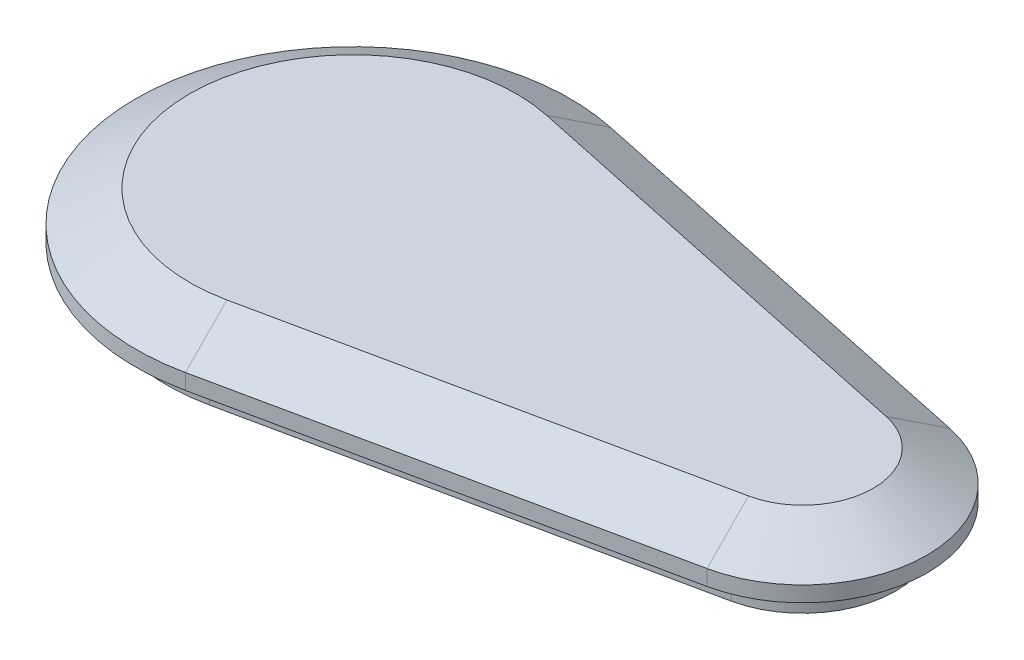
ISO-10303-21;
HEADER;
FILE_DESCRIPTION(('STEP AP214'),'2;1');
FILE_NAME('part.step','',(''),(''),'','','');
FILE_SCHEMA(('AUTOMOTIVE_DESIGN { 1 0 10303 214 1 1 1 1 }'));
ENDSEC;
DATA;
#1=APPLICATION_CONTEXT('core data for automotive mechanical design processes');
#2=APPLICATION_PROTOCOL_DEFINITION('international standard','automotive_design',2000,#1);
#3=PRODUCT_CONTEXT('',#1,'mechanical');
#4=PRODUCT('Part','Part','',(#3));
#5=PRODUCT_RELATED_PRODUCT_CATEGORY('part','',(#4));
#6=PRODUCT_DEFINITION_FORMATION('','',#4);
#7=PRODUCT_DEFINITION_CONTEXT('part definition',#1,'design');
#8=PRODUCT_DEFINITION('design','',#6,#7);
#9=PRODUCT_DEFINITION_SHAPE('','',#8);
#10=(LENGTH_UNIT() NAMED_UNIT(*) SI_UNIT(.MILLI.,.METRE.));
#11=(NAMED_UNIT(*) PLANE_ANGLE_UNIT() SI_UNIT($,.RADIAN.));
#12=(NAMED_UNIT(*) SI_UNIT($,.STERADIAN.) SOLID_ANGLE_UNIT());
#13=UNCERTAINTY_MEASURE_WITH_UNIT(LENGTH_MEASURE(1.E-05),#10,'distance_accuracy_value','');
#14=(GEOMETRIC_REPRESENTATION_CONTEXT(3) GLOBAL_UNCERTAINTY_ASSIGNED_CONTEXT((#13)) GLOBAL_UNIT_ASSIGNED_CONTEXT((#10,
#11,#12)) REPRESENTATION_CONTEXT('',''));
#15=CARTESIAN_POINT('',(0.,0.,0.));
#16=DIRECTION('',(0.,0.,1.));
#17=DIRECTION('',(1.,0.,0.));
#18=AXIS2_PLACEMENT_3D('',#15,#16,#17);
#19=CARTESIAN_POINT('',(0.,2.,0.));
#20=DIRECTION('',(0.,-1.,0.));
#21=DIRECTION('',(0.,0.,-1.));
#22=AXIS2_PLACEMENT_3D('',#19,#20,#21);
#23=CYLINDRICAL_SURFACE('',#22,12.);
#24=CARTESIAN_POINT('',(0.,0.,0.));
#25=DIRECTION('',(0.,1.,0.));
#26=DIRECTION('',(0.,0.,1.));
#27=AXIS2_PLACEMENT_3D('',#24,#25,#26);
#28=CIRCLE('',#27,12.);
#29=CARTESIAN_POINT('',(2.48275862068966,0.,-11.7403538971954));
#30=VERTEX_POINT('',#29);
#31=CARTESIAN_POINT('',(2.48275862068965,0.,11.7403538971954));
#32=VERTEX_POINT('',#31);
#33=EDGE_CURVE('E214',#30,#32,#28,.T.);
#34=ORIENTED_EDGE('',*,*,#33,.T.);
#35=DIRECTION('',(0.,-1.,0.));
#36=VECTOR('',#35,1.);
#37=CARTESIAN_POINT('',(2.48275862068965,2.,11.7403538971954));
#38=LINE('',#37,#36);
#39=CARTESIAN_POINT('',(2.48275862068965,2.,11.7403538971954));
#40=VERTEX_POINT('',#39);
#41=EDGE_CURVE('E11',#40,#32,#38,.T.);
#42=ORIENTED_EDGE('',*,*,#41,.F.);
#43=CARTESIAN_POINT('',(0.,2.,0.));
#44=DIRECTION('',(0.,1.,0.));
#45=DIRECTION('',(0.,0.,1.));
#46=AXIS2_PLACEMENT_3D('',#43,#44,#45);
#47=CIRCLE('',#46,12.);
#48=CARTESIAN_POINT('',(2.48275862068966,2.,-11.7403538971954));
#49=VERTEX_POINT('',#48);
#50=EDGE_CURVE('E215',#49,#40,#47,.T.);
#51=ORIENTED_EDGE('',*,*,#50,.F.);
#52=DIRECTION('',(0.,-1.,0.));
#53=VECTOR('',#52,1.);
#54=CARTESIAN_POINT('',(2.48275862068966,2.,-11.7403538971954));
#55=LINE('',#54,#53);
#56=EDGE_CURVE('E229',#49,#30,#55,.T.);
#57=ORIENTED_EDGE('',*,*,#56,.T.);
#58=EDGE_LOOP('',(#34,#42,#51,#57));
#59=FACE_BOUND('',#58,.T.);
#60=ADVANCED_FACE('F39',(#59),#23,.T.);
#61=CARTESIAN_POINT('',(2.48275862068965,2.,11.7403538971954));
#62=DIRECTION('',(-0.206896551724138,0.,-0.978362824766283));
#63=DIRECTION('',(-0.978362824766283,0.,0.206896551724138));
#64=AXIS2_PLACEMENT_3D('',#61,#62,#63);
#65=PLANE('',#64);
#66=DIRECTION('',(0.978362824766283,0.,-0.206896551724138));
#67=VECTOR('',#66,1.);
#68=CARTESIAN_POINT('',(2.48275862068965,0.,11.7403538971954));
#69=LINE('',#68,#67);
#70=CARTESIAN_POINT('',(30.2413793103448,0.,5.8701769485977));
#71=VERTEX_POINT('',#70);
#72=EDGE_CURVE('E233',#32,#71,#69,.T.);
#73=ORIENTED_EDGE('',*,*,#72,.T.);
#74=DIRECTION('',(0.,-1.,0.));
#75=VECTOR('',#74,1.);
#76=CARTESIAN_POINT('',(30.2413793103448,2.,5.8701769485977));
#77=LINE('',#76,#75);
#78=CARTESIAN_POINT('',(30.2413793103448,2.,5.8701769485977));
#79=VERTEX_POINT('',#78);
#80=EDGE_CURVE('E48',#79,#71,#77,.T.);
#81=ORIENTED_EDGE('',*,*,#80,.F.);
#82=DIRECTION('',(0.978362824766283,0.,-0.206896551724138));
#83=VECTOR('',#82,1.);
#84=CARTESIAN_POINT('',(2.48275862068965,2.,11.7403538971954));
#85=LINE('',#84,#83);
#86=EDGE_CURVE('E82',#40,#79,#85,.T.);
#87=ORIENTED_EDGE('',*,*,#86,.F.);
#88=ORIENTED_EDGE('',*,*,#41,.T.);
#89=EDGE_LOOP('',(#73,#81,#87,#88));
#90=FACE_BOUND('',#89,.T.);
#91=ADVANCED_FACE('F265',(#90),#65,.F.);
#92=CARTESIAN_POINT('',(29.,2.,0.));
#93=DIRECTION('',(0.,-1.,0.));
#94=DIRECTION('',(0.,0.,-1.));
#95=AXIS2_PLACEMENT_3D('',#92,#93,#94);
#96=CYLINDRICAL_SURFACE('',#95,6.);
#97=CARTESIAN_POINT('',(29.,0.,0.));
#98=DIRECTION('',(0.,1.,0.));
#99=DIRECTION('',(0.,0.,1.));
#100=AXIS2_PLACEMENT_3D('',#97,#98,#99);
#101=CIRCLE('',#100,6.);
#102=CARTESIAN_POINT('',(30.2413793103448,0.,-5.8701769485977));
#103=VERTEX_POINT('',#102);
#104=EDGE_CURVE('E72',#71,#103,#101,.T.);
#105=ORIENTED_EDGE('',*,*,#104,.T.);
#106=DIRECTION('',(0.,-1.,0.));
#107=VECTOR('',#106,1.);
#108=CARTESIAN_POINT('',(30.2413793103448,2.,-5.8701769485977));
#109=LINE('',#108,#107);
#110=CARTESIAN_POINT('',(30.2413793103448,2.,-5.8701769485977));
#111=VERTEX_POINT('',#110);
#112=EDGE_CURVE('E56',#111,#103,#109,.T.);
#113=ORIENTED_EDGE('',*,*,#112,.F.);
#114=CARTESIAN_POINT('',(29.,2.,0.));
#115=DIRECTION('',(0.,1.,0.));
#116=DIRECTION('',(0.,0.,1.));
#117=AXIS2_PLACEMENT_3D('',#114,#115,#116);
#118=CIRCLE('',#117,6.);
#119=EDGE_CURVE('E221',#79,#111,#118,.T.);
#120=ORIENTED_EDGE('',*,*,#119,.F.);
#121=ORIENTED_EDGE('',*,*,#80,.T.);
#122=EDGE_LOOP('',(#105,#113,#120,#121));
#123=FACE_BOUND('',#122,.T.);
#124=ADVANCED_FACE('F244',(#123),#96,.T.);
#125=CARTESIAN_POINT('',(2.48275862068966,2.,-11.7403538971954));
#126=DIRECTION('',(-0.206896551724138,0.,0.978362824766283));
#127=DIRECTION('',(0.978362824766283,0.,0.206896551724138));
#128=AXIS2_PLACEMENT_3D('',#125,#126,#127);
#129=PLANE('',#128);
#130=DIRECTION('',(-0.978362824766283,0.,-0.206896551724138));
#131=VECTOR('',#130,1.);
#132=CARTESIAN_POINT('',(2.48275862068966,0.,-11.7403538971954));
#133=LINE('',#132,#131);
#134=EDGE_CURVE('E77',#103,#30,#133,.T.);
#135=ORIENTED_EDGE('',*,*,#134,.T.);
#136=ORIENTED_EDGE('',*,*,#56,.F.);
#137=DIRECTION('',(-0.978362824766283,0.,-0.206896551724138));
#138=VECTOR('',#137,1.);
#139=CARTESIAN_POINT('',(2.48275862068966,2.,-11.7403538971954));
#140=LINE('',#139,#138);
#141=EDGE_CURVE('E225',#111,#49,#140,.T.);
#142=ORIENTED_EDGE('',*,*,#141,.F.);
#143=ORIENTED_EDGE('',*,*,#112,.T.);
#144=EDGE_LOOP('',(#135,#136,#142,#143));
#145=FACE_BOUND('',#144,.T.);
#146=ADVANCED_FACE('F249',(#145),#129,.F.);
#147=CARTESIAN_POINT('',(0.,0.,0.));
#148=DIRECTION('',(0.,1.,0.));
#149=DIRECTION('',(0.,0.,1.));
#150=AXIS2_PLACEMENT_3D('',#147,#148,#149);
#151=PLANE('',#150);
#152=ORIENTED_EDGE('',*,*,#33,.F.);
#153=ORIENTED_EDGE('',*,*,#134,.F.);
#154=ORIENTED_EDGE('',*,*,#104,.F.);
#155=ORIENTED_EDGE('',*,*,#72,.F.);
#156=EDGE_LOOP('',(#152,#153,#154,#155));
#157=FACE_BOUND('',#156,.T.);
#158=ADVANCED_FACE('F247',(#157),#151,.F.);
#159=CARTESIAN_POINT('',(29.,2.,0.));
#160=DIRECTION('',(0.,1.,0.));
#161=DIRECTION('',(0.,0.,1.));
#162=AXIS2_PLACEMENT_3D('',#159,#160,#161);
#163=PLANE('',#162);
#164=CARTESIAN_POINT('',(29.,2.,0.));
#165=DIRECTION('',(0.,1.,0.));
#166=DIRECTION('',(0.,0.,1.));
#167=AXIS2_PLACEMENT_3D('',#164,#165,#166);
#168=CIRCLE('',#167,8.);
#169=CARTESIAN_POINT('',(30.6551724137931,2.,7.82690259813027));
#170=VERTEX_POINT('',#169);
#171=CARTESIAN_POINT('',(30.6551724137931,2.,-7.82690259813027));
#172=VERTEX_POINT('',#171);
#173=EDGE_CURVE('E195',#170,#172,#168,.T.);
#174=ORIENTED_EDGE('',*,*,#173,.F.);
#175=DIRECTION('',(0.978362824766283,0.,-0.206896551724138));
#176=VECTOR('',#175,1.);
#177=CARTESIAN_POINT('',(2.89655172413793,2.,13.697079546728));
#178=LINE('',#177,#176);
#179=CARTESIAN_POINT('',(2.89655172413793,2.,13.697079546728));
#180=VERTEX_POINT('',#179);
#181=EDGE_CURVE('E140',#180,#170,#178,.T.);
#182=ORIENTED_EDGE('',*,*,#181,.F.);
#183=CARTESIAN_POINT('',(0.,2.,0.));
#184=DIRECTION('',(0.,1.,0.));
#185=DIRECTION('',(0.,0.,1.));
#186=AXIS2_PLACEMENT_3D('',#183,#184,#185);
#187=CIRCLE('',#186,14.);
#188=CARTESIAN_POINT('',(2.89655172413793,2.,-13.697079546728));
#189=VERTEX_POINT('',#188);
#190=EDGE_CURVE('E201',#189,#180,#187,.T.);
#191=ORIENTED_EDGE('',*,*,#190,.F.);
#192=DIRECTION('',(-0.978362824766283,0.,-0.206896551724138));
#193=VECTOR('',#192,1.);
#194=CARTESIAN_POINT('',(30.6551724137931,2.,-7.82690259813027));
#195=LINE('',#194,#193);
#196=EDGE_CURVE('E198',#172,#189,#195,.T.);
#197=ORIENTED_EDGE('',*,*,#196,.F.);
#198=EDGE_LOOP('',(#174,#182,#191,#197));
#199=FACE_BOUND('',#198,.T.);
#200=ORIENTED_EDGE('',*,*,#141,.T.);
#201=ORIENTED_EDGE('',*,*,#50,.T.);
#202=ORIENTED_EDGE('',*,*,#86,.T.);
#203=ORIENTED_EDGE('',*,*,#119,.T.);
#204=EDGE_LOOP('',(#200,#201,#202,#203));
#205=FACE_BOUND('',#204,.T.);
#206=ADVANCED_FACE('F251',(#199,#205),#163,.F.);
#207=CARTESIAN_POINT('',(29.,3.,0.));
#208=DIRECTION('',(0.,-1.,0.));
#209=DIRECTION('',(0.,0.,-1.));
#210=AXIS2_PLACEMENT_3D('',#207,#208,#209);
#211=CYLINDRICAL_SURFACE('',#210,8.);
#212=ORIENTED_EDGE('',*,*,#173,.T.);
#213=DIRECTION('',(0.,-1.,0.));
#214=VECTOR('',#213,1.);
#215=CARTESIAN_POINT('',(30.6551724137931,3.,-7.82690259813027));
#216=LINE('',#215,#214);
#217=CARTESIAN_POINT('',(30.6551724137931,3.,-7.82690259813027));
#218=VERTEX_POINT('',#217);
#219=EDGE_CURVE('E133',#218,#172,#216,.T.);
#220=ORIENTED_EDGE('',*,*,#219,.F.);
#221=CARTESIAN_POINT('',(29.,3.,0.));
#222=DIRECTION('',(0.,1.,0.));
#223=DIRECTION('',(0.,0.,1.));
#224=AXIS2_PLACEMENT_3D('',#221,#222,#223);
#225=CIRCLE('',#224,8.);
#226=CARTESIAN_POINT('',(30.6551724137931,3.,7.82690259813027));
#227=VERTEX_POINT('',#226);
#228=EDGE_CURVE('E126',#227,#218,#225,.T.);
#229=ORIENTED_EDGE('',*,*,#228,.F.);
#230=DIRECTION('',(0.,-1.,0.));
#231=VECTOR('',#230,1.);
#232=CARTESIAN_POINT('',(30.6551724137931,3.,7.82690259813027));
#233=LINE('',#232,#231);
#234=EDGE_CURVE('E130',#227,#170,#233,.T.);
#235=ORIENTED_EDGE('',*,*,#234,.T.);
#236=EDGE_LOOP('',(#212,#220,#229,#235));
#237=FACE_BOUND('',#236,.T.);
#238=ADVANCED_FACE('F129',(#237),#211,.T.);
#239=CARTESIAN_POINT('',(30.6551724137931,3.,-7.82690259813027));
#240=DIRECTION('',(-0.206896551724138,0.,0.978362824766283));
#241=DIRECTION('',(0.978362824766283,0.,0.206896551724138));
#242=AXIS2_PLACEMENT_3D('',#239,#240,#241);
#243=PLANE('',#242);
#244=ORIENTED_EDGE('',*,*,#196,.T.);
#245=DIRECTION('',(0.,-1.,0.));
#246=VECTOR('',#245,1.);
#247=CARTESIAN_POINT('',(2.89655172413793,3.,-13.697079546728));
#248=LINE('',#247,#246);
#249=CARTESIAN_POINT('',(2.89655172413793,3.,-13.697079546728));
#250=VERTEX_POINT('',#249);
#251=EDGE_CURVE('E208',#250,#189,#248,.T.);
#252=ORIENTED_EDGE('',*,*,#251,.F.);
#253=DIRECTION('',(-0.978362824766283,0.,-0.206896551724138));
#254=VECTOR('',#253,1.);
#255=CARTESIAN_POINT('',(30.6551724137931,3.,-7.82690259813027));
#256=LINE('',#255,#254);
#257=EDGE_CURVE('E139',#218,#250,#256,.T.);
#258=ORIENTED_EDGE('',*,*,#257,.F.);
#259=ORIENTED_EDGE('',*,*,#219,.T.);
#260=EDGE_LOOP('',(#244,#252,#258,#259));
#261=FACE_BOUND('',#260,.T.);
#262=ADVANCED_FACE('F259',(#261),#243,.F.);
#263=CARTESIAN_POINT('',(0.,3.,0.));
#264=DIRECTION('',(0.,-1.,0.));
#265=DIRECTION('',(0.,0.,-1.));
#266=AXIS2_PLACEMENT_3D('',#263,#264,#265);
#267=CYLINDRICAL_SURFACE('',#266,14.);
#268=ORIENTED_EDGE('',*,*,#190,.T.);
#269=DIRECTION('',(0.,-1.,0.));
#270=VECTOR('',#269,1.);
#271=CARTESIAN_POINT('',(2.89655172413793,3.,13.697079546728));
#272=LINE('',#271,#270);
#273=CARTESIAN_POINT('',(2.89655172413793,3.,13.697079546728));
#274=VERTEX_POINT('',#273);
#275=EDGE_CURVE('E151',#274,#180,#272,.T.);
#276=ORIENTED_EDGE('',*,*,#275,.F.);
#277=CARTESIAN_POINT('',(0.,3.,0.));
#278=DIRECTION('',(0.,1.,0.));
#279=DIRECTION('',(0.,0.,1.));
#280=AXIS2_PLACEMENT_3D('',#277,#278,#279);
#281=CIRCLE('',#280,14.);
#282=EDGE_CURVE('E163',#250,#274,#281,.T.);
#283=ORIENTED_EDGE('',*,*,#282,.F.);
#284=ORIENTED_EDGE('',*,*,#251,.T.);
#285=EDGE_LOOP('',(#268,#276,#283,#284));
#286=FACE_BOUND('',#285,.T.);
#287=ADVANCED_FACE('F278',(#286),#267,.T.);
#288=CARTESIAN_POINT('',(2.89655172413793,3.,13.697079546728));
#289=DIRECTION('',(-0.206896551724138,0.,-0.978362824766283));
#290=DIRECTION('',(-0.978362824766283,0.,0.206896551724138));
#291=AXIS2_PLACEMENT_3D('',#288,#289,#290);
#292=PLANE('',#291);
#293=ORIENTED_EDGE('',*,*,#181,.T.);
#294=ORIENTED_EDGE('',*,*,#234,.F.);
#295=DIRECTION('',(0.978362824766283,0.,-0.206896551724138));
#296=VECTOR('',#295,1.);
#297=CARTESIAN_POINT('',(2.89655172413793,3.,13.697079546728));
#298=LINE('',#297,#296);
#299=EDGE_CURVE('E147',#274,#227,#298,.T.);
#300=ORIENTED_EDGE('',*,*,#299,.F.);
#301=ORIENTED_EDGE('',*,*,#275,.T.);
#302=EDGE_LOOP('',(#293,#294,#300,#301));
#303=FACE_BOUND('',#302,.T.);
#304=ADVANCED_FACE('F145',(#303),#292,.F.);
#305=CARTESIAN_POINT('',(29.,3.,0.));
#306=DIRECTION('',(0.,-1.,0.));
#307=DIRECTION('',(0.,0.,1.));
#308=AXIS2_PLACEMENT_3D('',#305,#306,#307);
#309=CONICAL_SURFACE('',#308,8.,1.0471975511966);
#310=ORIENTED_EDGE('',*,*,#228,.T.);
#311=DIRECTION('',(0.179177669748505,-0.499999999999998,-0.847287060365906));
#312=VECTOR('',#311,1.);
#313=CARTESIAN_POINT('',(30.6551724137931,3.,-7.82690259813027));
#314=LINE('',#313,#312);
#315=CARTESIAN_POINT('',(29.9384617347991,5.,-4.43775435666663));
#316=VERTEX_POINT('',#315);
#317=EDGE_CURVE('E178',#316,#218,#314,.T.);
#318=ORIENTED_EDGE('',*,*,#317,.F.);
#319=CARTESIAN_POINT('',(29.,5.,0.));
#320=DIRECTION('',(0.,1.,0.));
#321=DIRECTION('',(0.,0.,1.));
#322=AXIS2_PLACEMENT_3D('',#319,#320,#321);
#323=CIRCLE('',#322,4.53589838486223);
#324=CARTESIAN_POINT('',(29.9384617347991,5.,4.43775435666663));
#325=VERTEX_POINT('',#324);
#326=EDGE_CURVE('E167',#325,#316,#323,.T.);
#327=ORIENTED_EDGE('',*,*,#326,.F.);
#328=DIRECTION('',(0.179177669748505,-0.499999999999998,0.847287060365906));
#329=VECTOR('',#328,1.);
#330=CARTESIAN_POINT('',(30.6551724137931,3.,7.82690259813027));
#331=LINE('',#330,#329);
#332=EDGE_CURVE('E158',#325,#227,#331,.T.);
#333=ORIENTED_EDGE('',*,*,#332,.T.);
#334=EDGE_LOOP('',(#310,#318,#327,#333));
#335=FACE_BOUND('',#334,.T.);
#336=ADVANCED_FACE('F165',(#335),#309,.T.);
#337=CARTESIAN_POINT('',(30.6551724137931,3.,-7.82690259813027));
#338=DIRECTION('',(0.103448275862069,0.86602540378444,-0.48918141238314));
#339=DIRECTION('',(0.,0.491820108607575,0.870696836315162));
#340=AXIS2_PLACEMENT_3D('',#337,#338,#339);
#341=PLANE('',#340);
#342=ORIENTED_EDGE('',*,*,#257,.T.);
#343=DIRECTION('',(0.179177669748504,-0.499999999999998,-0.847287060365906));
#344=VECTOR('',#343,1.);
#345=CARTESIAN_POINT('',(2.89655172413792,3.,-13.697079546728));
#346=LINE('',#345,#344);
#347=CARTESIAN_POINT('',(2.1798410451439,5.,-10.3079313052643));
#348=VERTEX_POINT('',#347);
#349=EDGE_CURVE('E173',#348,#250,#346,.T.);
#350=ORIENTED_EDGE('',*,*,#349,.F.);
#351=DIRECTION('',(0.978362824766283,0.,0.206896551724138));
#352=VECTOR('',#351,1.);
#353=CARTESIAN_POINT('',(29.9384617347991,5.,-4.43775435666663));
#354=LINE('',#353,#352);
#355=EDGE_CURVE('E185',#316,#348,#354,.F.);
#356=ORIENTED_EDGE('',*,*,#355,.F.);
#357=ORIENTED_EDGE('',*,*,#317,.T.);
#358=EDGE_LOOP('',(#342,#350,#356,#357));
#359=FACE_BOUND('',#358,.T.);
#360=ADVANCED_FACE('F286',(#359),#341,.T.);
#361=CARTESIAN_POINT('',(0.,3.,0.));
#362=DIRECTION('',(0.,-1.,0.));
#363=DIRECTION('',(0.,0.,1.));
#364=AXIS2_PLACEMENT_3D('',#361,#362,#363);
#365=CONICAL_SURFACE('',#364,14.,1.0471975511966);
#366=ORIENTED_EDGE('',*,*,#282,.T.);
#367=DIRECTION('',(0.179177669748505,-0.499999999999998,0.847287060365906));
#368=VECTOR('',#367,1.);
#369=CARTESIAN_POINT('',(2.89655172413793,3.,13.697079546728));
#370=LINE('',#369,#368);
#371=CARTESIAN_POINT('',(2.17984104514391,5.,10.3079313052643));
#372=VERTEX_POINT('',#371);
#373=EDGE_CURVE('E161',#372,#274,#370,.T.);
#374=ORIENTED_EDGE('',*,*,#373,.F.);
#375=CARTESIAN_POINT('',(0.,5.,0.));
#376=DIRECTION('',(0.,1.,0.));
#377=DIRECTION('',(0.,0.,1.));
#378=AXIS2_PLACEMENT_3D('',#375,#376,#377);
#379=CIRCLE('',#378,10.5358983848622);
#380=EDGE_CURVE('E175',#348,#372,#379,.T.);
#381=ORIENTED_EDGE('',*,*,#380,.F.);
#382=ORIENTED_EDGE('',*,*,#349,.T.);
#383=EDGE_LOOP('',(#366,#374,#381,#382));
#384=FACE_BOUND('',#383,.T.);
#385=ADVANCED_FACE('F291',(#384),#365,.T.);
#386=CARTESIAN_POINT('',(2.89655172413793,3.,13.697079546728));
#387=DIRECTION('',(0.103448275862069,0.86602540378444,0.48918141238314));
#388=DIRECTION('',(0.,-0.491820108607575,0.870696836315162));
#389=AXIS2_PLACEMENT_3D('',#386,#387,#388);
#390=PLANE('',#389);
#391=ORIENTED_EDGE('',*,*,#299,.T.);
#392=ORIENTED_EDGE('',*,*,#332,.F.);
#393=DIRECTION('',(-0.978362824766283,0.,0.206896551724138));
#394=VECTOR('',#393,1.);
#395=CARTESIAN_POINT('',(2.17984104514391,5.,10.3079313052643));
#396=LINE('',#395,#394);
#397=EDGE_CURVE('E169',#372,#325,#396,.F.);
#398=ORIENTED_EDGE('',*,*,#397,.F.);
#399=ORIENTED_EDGE('',*,*,#373,.T.);
#400=EDGE_LOOP('',(#391,#392,#398,#399));
#401=FACE_BOUND('',#400,.T.);
#402=ADVANCED_FACE('F156',(#401),#390,.T.);
#403=CARTESIAN_POINT('',(29.,5.,0.));
#404=DIRECTION('',(0.,1.,0.));
#405=DIRECTION('',(0.,0.,1.));
#406=AXIS2_PLACEMENT_3D('',#403,#404,#405);
#407=PLANE('',#406);
#408=ORIENTED_EDGE('',*,*,#326,.T.);
#409=ORIENTED_EDGE('',*,*,#355,.T.);
#410=ORIENTED_EDGE('',*,*,#380,.T.);
#411=ORIENTED_EDGE('',*,*,#397,.T.);
#412=EDGE_LOOP('',(#408,#409,#410,#411));
#413=FACE_BOUND('',#412,.T.);
#414=ADVANCED_FACE('F295',(#413),#407,.T.);
#415=CLOSED_SHELL('',(#60,#91,#124,#146,#158,#206,#238,#262,#287,#304,#336,#360,#385,#402,#414));
#416=MANIFOLD_SOLID_BREP('B2',#415);
#417=ADVANCED_BREP_SHAPE_REPRESENTATION('',(#18,#416),#14);
#418=SHAPE_DEFINITION_REPRESENTATION(#9,#417);
ENDSEC;
END-ISO-10303-21;
